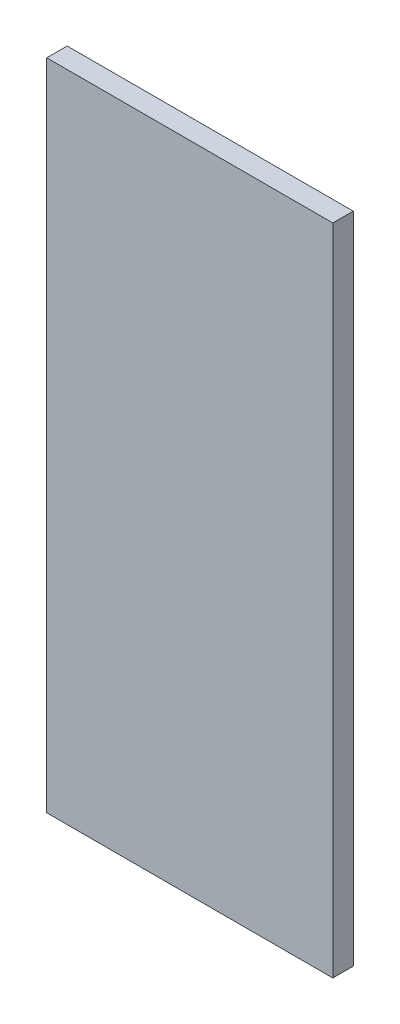
ISO-10303-21;
HEADER;
FILE_DESCRIPTION(('STEP AP214'),'2;1');
FILE_NAME('part.step','',(''),(''),'','','');
FILE_SCHEMA(('AUTOMOTIVE_DESIGN { 1 0 10303 214 1 1 1 1 }'));
ENDSEC;
DATA;
#1=APPLICATION_CONTEXT('core data for automotive mechanical design processes');
#2=APPLICATION_PROTOCOL_DEFINITION('international standard','automotive_design',2000,#1);
#3=PRODUCT_CONTEXT('',#1,'mechanical');
#4=PRODUCT('Part','Part','',(#3));
#5=PRODUCT_RELATED_PRODUCT_CATEGORY('part','',(#4));
#6=PRODUCT_DEFINITION_FORMATION('','',#4);
#7=PRODUCT_DEFINITION_CONTEXT('part definition',#1,'design');
#8=PRODUCT_DEFINITION('design','',#6,#7);
#9=PRODUCT_DEFINITION_SHAPE('','',#8);
#10=(LENGTH_UNIT() NAMED_UNIT(*) SI_UNIT(.MILLI.,.METRE.));
#11=(NAMED_UNIT(*) PLANE_ANGLE_UNIT() SI_UNIT($,.RADIAN.));
#12=(NAMED_UNIT(*) SI_UNIT($,.STERADIAN.) SOLID_ANGLE_UNIT());
#13=UNCERTAINTY_MEASURE_WITH_UNIT(LENGTH_MEASURE(1.E-05),#10,'distance_accuracy_value','');
#14=(GEOMETRIC_REPRESENTATION_CONTEXT(3) GLOBAL_UNCERTAINTY_ASSIGNED_CONTEXT((#13)) GLOBAL_UNIT_ASSIGNED_CONTEXT((#10,
#11,#12)) REPRESENTATION_CONTEXT('',''));
#15=CARTESIAN_POINT('',(0.,0.,0.));
#16=DIRECTION('',(0.,0.,1.));
#17=DIRECTION('',(1.,0.,0.));
#18=AXIS2_PLACEMENT_3D('',#15,#16,#17);
#19=CARTESIAN_POINT('',(0.,203.2,0.));
#20=DIRECTION('',(1.,0.,0.));
#21=DIRECTION('',(0.,0.,-1.));
#22=AXIS2_PLACEMENT_3D('',#19,#20,#21);
#23=PLANE('',#22);
#24=DIRECTION('',(0.,0.,1.));
#25=VECTOR('',#24,1.);
#26=CARTESIAN_POINT('',(0.,0.,0.));
#27=LINE('',#26,#25);
#28=CARTESIAN_POINT('',(0.,0.,-6.35));
#29=VERTEX_POINT('',#28);
#30=CARTESIAN_POINT('',(0.,0.,0.));
#31=VERTEX_POINT('',#30);
#32=EDGE_CURVE('E95',#29,#31,#27,.T.);
#33=ORIENTED_EDGE('',*,*,#32,.T.);
#34=DIRECTION('',(0.,-1.,0.));
#35=VECTOR('',#34,1.);
#36=CARTESIAN_POINT('',(0.,203.2,0.));
#37=LINE('',#36,#35);
#38=CARTESIAN_POINT('',(0.,203.2,0.));
#39=VERTEX_POINT('',#38);
#40=EDGE_CURVE('E11',#39,#31,#37,.T.);
#41=ORIENTED_EDGE('',*,*,#40,.F.);
#42=DIRECTION('',(0.,0.,1.));
#43=VECTOR('',#42,1.);
#44=CARTESIAN_POINT('',(0.,203.2,0.));
#45=LINE('',#44,#43);
#46=CARTESIAN_POINT('',(0.,203.2,-6.35));
#47=VERTEX_POINT('',#46);
#48=EDGE_CURVE('E83',#47,#39,#45,.T.);
#49=ORIENTED_EDGE('',*,*,#48,.F.);
#50=DIRECTION('',(0.,-1.,0.));
#51=VECTOR('',#50,1.);
#52=CARTESIAN_POINT('',(0.,203.2,-6.35));
#53=LINE('',#52,#51);
#54=EDGE_CURVE('E91',#47,#29,#53,.T.);
#55=ORIENTED_EDGE('',*,*,#54,.T.);
#56=EDGE_LOOP('',(#33,#41,#49,#55));
#57=FACE_BOUND('',#56,.T.);
#58=ADVANCED_FACE('F32',(#57),#23,.F.);
#59=CARTESIAN_POINT('',(0.,203.2,0.));
#60=DIRECTION('',(0.,0.,-1.));
#61=DIRECTION('',(-1.,0.,0.));
#62=AXIS2_PLACEMENT_3D('',#59,#60,#61);
#63=PLANE('',#62);
#64=DIRECTION('',(1.,0.,0.));
#65=VECTOR('',#64,1.);
#66=CARTESIAN_POINT('',(0.,0.,0.));
#67=LINE('',#66,#65);
#68=CARTESIAN_POINT('',(88.9,0.,0.));
#69=VERTEX_POINT('',#68);
#70=EDGE_CURVE('E87',#31,#69,#67,.T.);
#71=ORIENTED_EDGE('',*,*,#70,.T.);
#72=DIRECTION('',(0.,-1.,0.));
#73=VECTOR('',#72,1.);
#74=CARTESIAN_POINT('',(88.9,203.2,0.));
#75=LINE('',#74,#73);
#76=CARTESIAN_POINT('',(88.9,203.2,0.));
#77=VERTEX_POINT('',#76);
#78=EDGE_CURVE('E40',#77,#69,#75,.T.);
#79=ORIENTED_EDGE('',*,*,#78,.F.);
#80=DIRECTION('',(1.,0.,0.));
#81=VECTOR('',#80,1.);
#82=CARTESIAN_POINT('',(0.,203.2,0.));
#83=LINE('',#82,#81);
#84=EDGE_CURVE('E78',#39,#77,#83,.T.);
#85=ORIENTED_EDGE('',*,*,#84,.F.);
#86=ORIENTED_EDGE('',*,*,#40,.T.);
#87=EDGE_LOOP('',(#71,#79,#85,#86));
#88=FACE_BOUND('',#87,.T.);
#89=ADVANCED_FACE('F86',(#88),#63,.F.);
#90=CARTESIAN_POINT('',(88.9,203.2,0.));
#91=DIRECTION('',(-1.,0.,0.));
#92=DIRECTION('',(0.,0.,1.));
#93=AXIS2_PLACEMENT_3D('',#90,#91,#92);
#94=PLANE('',#93);
#95=DIRECTION('',(0.,0.,-1.));
#96=VECTOR('',#95,1.);
#97=CARTESIAN_POINT('',(88.9,0.,0.));
#98=LINE('',#97,#96);
#99=CARTESIAN_POINT('',(88.9,0.,-6.35));
#100=VERTEX_POINT('',#99);
#101=EDGE_CURVE('E65',#69,#100,#98,.T.);
#102=ORIENTED_EDGE('',*,*,#101,.T.);
#103=DIRECTION('',(0.,-1.,0.));
#104=VECTOR('',#103,1.);
#105=CARTESIAN_POINT('',(88.9,203.2,-6.35));
#106=LINE('',#105,#104);
#107=CARTESIAN_POINT('',(88.9,203.2,-6.35));
#108=VERTEX_POINT('',#107);
#109=EDGE_CURVE('E88',#108,#100,#106,.T.);
#110=ORIENTED_EDGE('',*,*,#109,.F.);
#111=DIRECTION('',(0.,0.,-1.));
#112=VECTOR('',#111,1.);
#113=CARTESIAN_POINT('',(88.9,203.2,0.));
#114=LINE('',#113,#112);
#115=EDGE_CURVE('E81',#77,#108,#114,.T.);
#116=ORIENTED_EDGE('',*,*,#115,.F.);
#117=ORIENTED_EDGE('',*,*,#78,.T.);
#118=EDGE_LOOP('',(#102,#110,#116,#117));
#119=FACE_BOUND('',#118,.T.);
#120=ADVANCED_FACE('F89',(#119),#94,.F.);
#121=CARTESIAN_POINT('',(0.,203.2,-6.35));
#122=DIRECTION('',(0.,0.,1.));
#123=DIRECTION('',(1.,0.,0.));
#124=AXIS2_PLACEMENT_3D('',#121,#122,#123);
#125=PLANE('',#124);
#126=DIRECTION('',(-1.,0.,0.));
#127=VECTOR('',#126,1.);
#128=CARTESIAN_POINT('',(0.,0.,-6.35));
#129=LINE('',#128,#127);
#130=EDGE_CURVE('E71',#100,#29,#129,.T.);
#131=ORIENTED_EDGE('',*,*,#130,.T.);
#132=ORIENTED_EDGE('',*,*,#54,.F.);
#133=DIRECTION('',(-1.,0.,0.));
#134=VECTOR('',#133,1.);
#135=CARTESIAN_POINT('',(0.,203.2,-6.35));
#136=LINE('',#135,#134);
#137=EDGE_CURVE('E48',#108,#47,#136,.T.);
#138=ORIENTED_EDGE('',*,*,#137,.F.);
#139=ORIENTED_EDGE('',*,*,#109,.T.);
#140=EDGE_LOOP('',(#131,#132,#138,#139));
#141=FACE_BOUND('',#140,.T.);
#142=ADVANCED_FACE('F102',(#141),#125,.F.);
#143=CARTESIAN_POINT('',(0.,203.2,0.));
#144=DIRECTION('',(0.,-1.,0.));
#145=DIRECTION('',(0.,0.,-1.));
#146=AXIS2_PLACEMENT_3D('',#143,#144,#145);
#147=PLANE('',#146);
#148=ORIENTED_EDGE('',*,*,#48,.T.);
#149=ORIENTED_EDGE('',*,*,#84,.T.);
#150=ORIENTED_EDGE('',*,*,#115,.T.);
#151=ORIENTED_EDGE('',*,*,#137,.T.);
#152=EDGE_LOOP('',(#148,#149,#150,#151));
#153=FACE_BOUND('',#152,.T.);
#154=ADVANCED_FACE('F79',(#153),#147,.F.);
#155=CARTESIAN_POINT('',(0.,0.,0.));
#156=DIRECTION('',(0.,-1.,0.));
#157=DIRECTION('',(0.,0.,-1.));
#158=AXIS2_PLACEMENT_3D('',#155,#156,#157);
#159=PLANE('',#158);
#160=ORIENTED_EDGE('',*,*,#32,.F.);
#161=ORIENTED_EDGE('',*,*,#130,.F.);
#162=ORIENTED_EDGE('',*,*,#101,.F.);
#163=ORIENTED_EDGE('',*,*,#70,.F.);
#164=EDGE_LOOP('',(#160,#161,#162,#163));
#165=FACE_BOUND('',#164,.T.);
#166=ADVANCED_FACE('F105',(#165),#159,.T.);
#167=CLOSED_SHELL('',(#58,#89,#120,#142,#154,#166));
#168=MANIFOLD_SOLID_BREP('B2',#167);
#169=ADVANCED_BREP_SHAPE_REPRESENTATION('',(#18,#168),#14);
#170=SHAPE_DEFINITION_REPRESENTATION(#9,#169);
ENDSEC;
END-ISO-10303-21;
